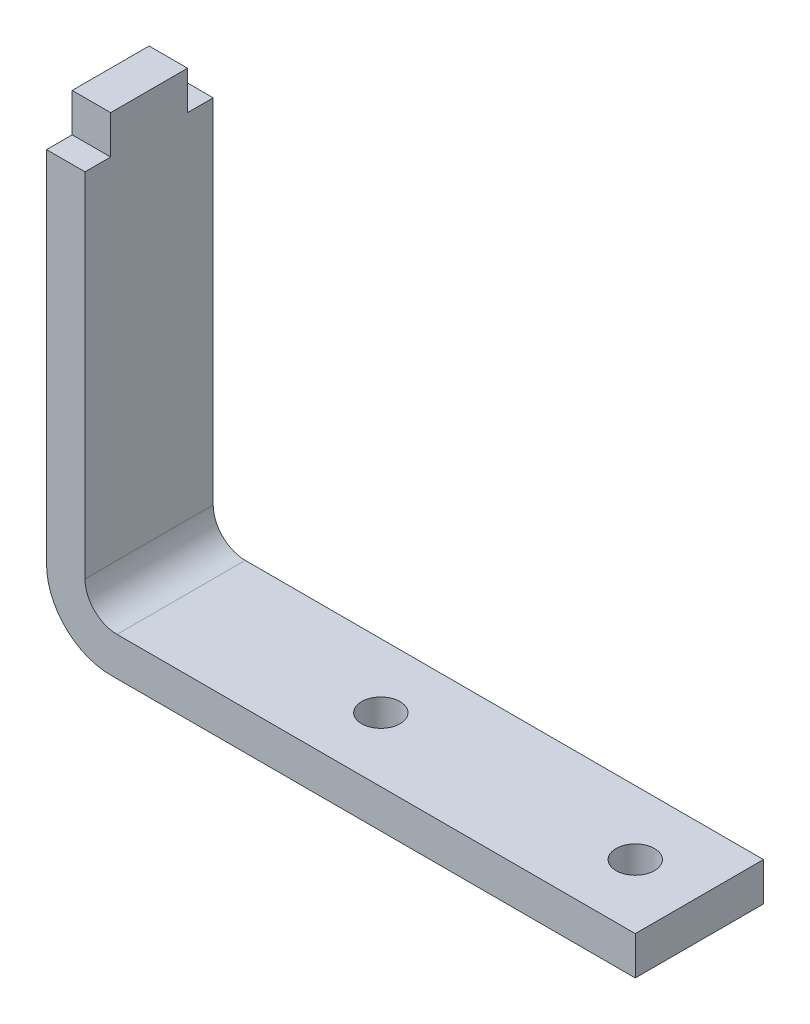
ISO-10303-21;
HEADER;
FILE_DESCRIPTION(('STEP AP214'),'2;1');
FILE_NAME('part.step','',(''),(''),'','','');
FILE_SCHEMA(('AUTOMOTIVE_DESIGN { 1 0 10303 214 1 1 1 1 }'));
ENDSEC;
DATA;
#1=APPLICATION_CONTEXT('core data for automotive mechanical design processes');
#2=APPLICATION_PROTOCOL_DEFINITION('international standard','automotive_design',2000,#1);
#3=PRODUCT_CONTEXT('',#1,'mechanical');
#4=PRODUCT('Part','Part','',(#3));
#5=PRODUCT_RELATED_PRODUCT_CATEGORY('part','',(#4));
#6=PRODUCT_DEFINITION_FORMATION('','',#4);
#7=PRODUCT_DEFINITION_CONTEXT('part definition',#1,'design');
#8=PRODUCT_DEFINITION('design','',#6,#7);
#9=PRODUCT_DEFINITION_SHAPE('','',#8);
#10=(LENGTH_UNIT() NAMED_UNIT(*) SI_UNIT(.MILLI.,.METRE.));
#11=(NAMED_UNIT(*) PLANE_ANGLE_UNIT() SI_UNIT($,.RADIAN.));
#12=(NAMED_UNIT(*) SI_UNIT($,.STERADIAN.) SOLID_ANGLE_UNIT());
#13=UNCERTAINTY_MEASURE_WITH_UNIT(LENGTH_MEASURE(1.E-05),#10,'distance_accuracy_value','');
#14=(GEOMETRIC_REPRESENTATION_CONTEXT(3) GLOBAL_UNCERTAINTY_ASSIGNED_CONTEXT((#13)) GLOBAL_UNIT_ASSIGNED_CONTEXT((#10,
#11,#12)) REPRESENTATION_CONTEXT('',''));
#15=CARTESIAN_POINT('',(0.,0.,0.));
#16=DIRECTION('',(0.,0.,1.));
#17=DIRECTION('',(1.,0.,0.));
#18=AXIS2_PLACEMENT_3D('',#15,#16,#17);
#19=CARTESIAN_POINT('',(0.,33.,-5.));
#20=DIRECTION('',(0.,-1.,0.));
#21=DIRECTION('',(0.,0.,-1.));
#22=AXIS2_PLACEMENT_3D('',#19,#20,#21);
#23=PLANE('',#22);
#24=DIRECTION('',(-1.,0.,0.));
#25=VECTOR('',#24,1.);
#26=CARTESIAN_POINT('',(-55.9999999999999,32.9999999999999,-3.));
#27=LINE('',#26,#25);
#28=CARTESIAN_POINT('',(-56.,33.,-3.));
#29=VERTEX_POINT('',#28);
#30=CARTESIAN_POINT('',(-58.9999999999999,32.9999999999999,-3.));
#31=VERTEX_POINT('',#30);
#32=EDGE_CURVE('E145',#29,#31,#27,.T.);
#33=ORIENTED_EDGE('',*,*,#32,.F.);
#34=DIRECTION('',(0.,0.,1.));
#35=VECTOR('',#34,1.);
#36=CARTESIAN_POINT('',(-56.,33.,-5.));
#37=LINE('',#36,#35);
#38=CARTESIAN_POINT('',(-56.,33.,-5.));
#39=VERTEX_POINT('',#38);
#40=EDGE_CURVE('E208',#39,#29,#37,.T.);
#41=ORIENTED_EDGE('',*,*,#40,.F.);
#42=DIRECTION('',(1.,0.,0.));
#43=VECTOR('',#42,1.);
#44=CARTESIAN_POINT('',(0.,33.,-5.));
#45=LINE('',#44,#43);
#46=CARTESIAN_POINT('',(-59.,33.,-5.));
#47=VERTEX_POINT('',#46);
#48=EDGE_CURVE('E188',#47,#39,#45,.T.);
#49=ORIENTED_EDGE('',*,*,#48,.F.);
#50=DIRECTION('',(0.,0.,1.));
#51=VECTOR('',#50,1.);
#52=CARTESIAN_POINT('',(-59.,33.,-5.));
#53=LINE('',#52,#51);
#54=EDGE_CURVE('E204',#47,#31,#53,.T.);
#55=ORIENTED_EDGE('',*,*,#54,.T.);
#56=EDGE_LOOP('',(#33,#41,#49,#55));
#57=FACE_BOUND('',#56,.T.);
#58=ADVANCED_FACE('F35',(#57),#23,.F.);
#59=CARTESIAN_POINT('',(0.,0.,-5.));
#60=DIRECTION('',(0.,1.,0.));
#61=DIRECTION('',(-1.,0.,0.));
#62=AXIS2_PLACEMENT_3D('',#59,#60,#61);
#63=PLANE('',#62);
#64=CARTESIAN_POINT('',(-18.075,0.,0.));
#65=DIRECTION('',(0.,1.,0.));
#66=DIRECTION('',(-1.,0.,0.));
#67=AXIS2_PLACEMENT_3D('',#64,#65,#66);
#68=CIRCLE('',#67,1.5);
#69=CARTESIAN_POINT('',(-19.575,0.,0.));
#70=VERTEX_POINT('',#69);
#71=EDGE_CURVE('E169',#70,#70,#68,.T.);
#72=ORIENTED_EDGE('',*,*,#71,.T.);
#73=EDGE_LOOP('',(#72));
#74=FACE_BOUND('',#73,.T.);
#75=CARTESIAN_POINT('',(-37.925,0.,0.));
#76=DIRECTION('',(0.,1.,0.));
#77=DIRECTION('',(-1.,0.,0.));
#78=AXIS2_PLACEMENT_3D('',#75,#76,#77);
#79=CIRCLE('',#78,1.5);
#80=CARTESIAN_POINT('',(-39.425,0.,0.));
#81=VERTEX_POINT('',#80);
#82=EDGE_CURVE('E176',#81,#81,#79,.T.);
#83=ORIENTED_EDGE('',*,*,#82,.T.);
#84=EDGE_LOOP('',(#83));
#85=FACE_BOUND('',#84,.T.);
#86=DIRECTION('',(-1.,0.,0.));
#87=VECTOR('',#86,1.);
#88=CARTESIAN_POINT('',(0.,0.,-5.));
#89=LINE('',#88,#87);
#90=CARTESIAN_POINT('',(-13.075,0.,-5.));
#91=VERTEX_POINT('',#90);
#92=CARTESIAN_POINT('',(-54.,0.,-5.));
#93=VERTEX_POINT('',#92);
#94=EDGE_CURVE('E192',#91,#93,#89,.T.);
#95=ORIENTED_EDGE('',*,*,#94,.F.);
#96=DIRECTION('',(0.,0.,1.));
#97=VECTOR('',#96,1.);
#98=CARTESIAN_POINT('',(-13.075,0.,5.));
#99=LINE('',#98,#97);
#100=CARTESIAN_POINT('',(-13.075,0.,5.));
#101=VERTEX_POINT('',#100);
#102=EDGE_CURVE('E159',#91,#101,#99,.T.);
#103=ORIENTED_EDGE('',*,*,#102,.T.);
#104=DIRECTION('',(-1.,0.,0.));
#105=VECTOR('',#104,1.);
#106=CARTESIAN_POINT('',(0.,0.,5.));
#107=LINE('',#106,#105);
#108=CARTESIAN_POINT('',(-54.,0.,5.));
#109=VERTEX_POINT('',#108);
#110=EDGE_CURVE('E185',#101,#109,#107,.T.);
#111=ORIENTED_EDGE('',*,*,#110,.T.);
#112=DIRECTION('',(0.,0.,1.));
#113=VECTOR('',#112,1.);
#114=CARTESIAN_POINT('',(-54.,0.,-5.));
#115=LINE('',#114,#113);
#116=EDGE_CURVE('E215',#109,#93,#115,.F.);
#117=ORIENTED_EDGE('',*,*,#116,.T.);
#118=EDGE_LOOP('',(#95,#103,#111,#117));
#119=FACE_BOUND('',#118,.T.);
#120=ADVANCED_FACE('F248',(#74,#85,#119),#63,.F.);
#121=CARTESIAN_POINT('',(-59.,0.,-5.));
#122=DIRECTION('',(1.,0.,0.));
#123=DIRECTION('',(0.,0.,-1.));
#124=AXIS2_PLACEMENT_3D('',#121,#122,#123);
#125=PLANE('',#124);
#126=DIRECTION('',(0.,1.,0.));
#127=VECTOR('',#126,1.);
#128=CARTESIAN_POINT('',(-59.,0.,-5.));
#129=LINE('',#128,#127);
#130=CARTESIAN_POINT('',(-59.,4.99999999999999,-5.));
#131=VERTEX_POINT('',#130);
#132=EDGE_CURVE('E190',#131,#47,#129,.T.);
#133=ORIENTED_EDGE('',*,*,#132,.F.);
#134=DIRECTION('',(0.,0.,1.));
#135=VECTOR('',#134,1.);
#136=CARTESIAN_POINT('',(-59.,4.99999999999999,-5.));
#137=LINE('',#136,#135);
#138=CARTESIAN_POINT('',(-59.,4.99999999999999,5.));
#139=VERTEX_POINT('',#138);
#140=EDGE_CURVE('E206',#131,#139,#137,.T.);
#141=ORIENTED_EDGE('',*,*,#140,.T.);
#142=DIRECTION('',(0.,1.,0.));
#143=VECTOR('',#142,1.);
#144=CARTESIAN_POINT('',(-59.,0.,5.));
#145=LINE('',#144,#143);
#146=CARTESIAN_POINT('',(-59.,33.,5.));
#147=VERTEX_POINT('',#146);
#148=EDGE_CURVE('E200',#139,#147,#145,.T.);
#149=ORIENTED_EDGE('',*,*,#148,.T.);
#150=CARTESIAN_POINT('',(-59.,33.,3.));
#151=VERTEX_POINT('',#150);
#152=EDGE_CURVE('E207',#151,#147,#53,.T.);
#153=ORIENTED_EDGE('',*,*,#152,.F.);
#154=DIRECTION('',(0.,-1.,0.));
#155=VECTOR('',#154,1.);
#156=CARTESIAN_POINT('',(-58.9999999999999,35.9999999999999,3.));
#157=LINE('',#156,#155);
#158=CARTESIAN_POINT('',(-58.9999999999999,35.9999999999999,3.));
#159=VERTEX_POINT('',#158);
#160=EDGE_CURVE('E128',#159,#151,#157,.T.);
#161=ORIENTED_EDGE('',*,*,#160,.F.);
#162=DIRECTION('',(0.,0.,1.));
#163=VECTOR('',#162,1.);
#164=CARTESIAN_POINT('',(-58.9999999999999,35.9999999999999,-3.));
#165=LINE('',#164,#163);
#166=CARTESIAN_POINT('',(-58.9999999999999,35.9999999999999,-3.));
#167=VERTEX_POINT('',#166);
#168=EDGE_CURVE('E136',#167,#159,#165,.T.);
#169=ORIENTED_EDGE('',*,*,#168,.F.);
#170=DIRECTION('',(0.,-1.,0.));
#171=VECTOR('',#170,1.);
#172=CARTESIAN_POINT('',(-58.9999999999999,35.9999999999999,-3.));
#173=LINE('',#172,#171);
#174=EDGE_CURVE('E155',#167,#31,#173,.T.);
#175=ORIENTED_EDGE('',*,*,#174,.T.);
#176=ORIENTED_EDGE('',*,*,#54,.F.);
#177=EDGE_LOOP('',(#133,#141,#149,#153,#161,#169,#175,#176));
#178=FACE_BOUND('',#177,.T.);
#179=ADVANCED_FACE('F255',(#178),#125,.F.);
#180=CARTESIAN_POINT('',(-56.,33.,3.));
#181=VERTEX_POINT('',#180);
#182=CARTESIAN_POINT('',(-56.,33.,5.));
#183=VERTEX_POINT('',#182);
#184=EDGE_CURVE('E55',#181,#183,#37,.T.);
#185=ORIENTED_EDGE('',*,*,#184,.F.);
#186=DIRECTION('',(-1.,0.,0.));
#187=VECTOR('',#186,1.);
#188=CARTESIAN_POINT('',(-55.9999999999999,32.9999999999999,3.));
#189=LINE('',#188,#187);
#190=EDGE_CURVE('E50',#181,#151,#189,.T.);
#191=ORIENTED_EDGE('',*,*,#190,.T.);
#192=ORIENTED_EDGE('',*,*,#152,.T.);
#193=DIRECTION('',(1.,0.,0.));
#194=VECTOR('',#193,1.);
#195=CARTESIAN_POINT('',(0.,33.,5.));
#196=LINE('',#195,#194);
#197=EDGE_CURVE('E198',#147,#183,#196,.T.);
#198=ORIENTED_EDGE('',*,*,#197,.T.);
#199=EDGE_LOOP('',(#185,#191,#192,#198));
#200=FACE_BOUND('',#199,.T.);
#201=ADVANCED_FACE('F271',(#200),#23,.F.);
#202=CARTESIAN_POINT('',(-56.,0.,-5.));
#203=DIRECTION('',(-1.,0.,0.));
#204=DIRECTION('',(0.,-1.,0.));
#205=AXIS2_PLACEMENT_3D('',#202,#203,#204);
#206=PLANE('',#205);
#207=DIRECTION('',(0.,-1.,0.));
#208=VECTOR('',#207,1.);
#209=CARTESIAN_POINT('',(-56.,0.,5.));
#210=LINE('',#209,#208);
#211=CARTESIAN_POINT('',(-56.,5.5,5.));
#212=VERTEX_POINT('',#211);
#213=EDGE_CURVE('E196',#183,#212,#210,.T.);
#214=ORIENTED_EDGE('',*,*,#213,.T.);
#215=DIRECTION('',(0.,0.,1.));
#216=VECTOR('',#215,1.);
#217=CARTESIAN_POINT('',(-56.,5.5,-5.));
#218=LINE('',#217,#216);
#219=CARTESIAN_POINT('',(-56.,5.5,-5.));
#220=VERTEX_POINT('',#219);
#221=EDGE_CURVE('E223',#212,#220,#218,.F.);
#222=ORIENTED_EDGE('',*,*,#221,.T.);
#223=DIRECTION('',(0.,-1.,0.));
#224=VECTOR('',#223,1.);
#225=CARTESIAN_POINT('',(-56.,0.,-5.));
#226=LINE('',#225,#224);
#227=EDGE_CURVE('E184',#39,#220,#226,.T.);
#228=ORIENTED_EDGE('',*,*,#227,.F.);
#229=ORIENTED_EDGE('',*,*,#40,.T.);
#230=DIRECTION('',(0.,-1.,0.));
#231=VECTOR('',#230,1.);
#232=CARTESIAN_POINT('',(-55.9999999999999,35.9999999999999,-3.));
#233=LINE('',#232,#231);
#234=CARTESIAN_POINT('',(-55.9999999999999,35.9999999999999,-3.));
#235=VERTEX_POINT('',#234);
#236=EDGE_CURVE('E143',#235,#29,#233,.T.);
#237=ORIENTED_EDGE('',*,*,#236,.F.);
#238=DIRECTION('',(0.,0.,1.));
#239=VECTOR('',#238,1.);
#240=CARTESIAN_POINT('',(-55.9999999999999,35.9999999999999,-3.));
#241=LINE('',#240,#239);
#242=CARTESIAN_POINT('',(-55.9999999999999,35.9999999999999,3.));
#243=VERTEX_POINT('',#242);
#244=EDGE_CURVE('E134',#235,#243,#241,.T.);
#245=ORIENTED_EDGE('',*,*,#244,.T.);
#246=DIRECTION('',(0.,-1.,0.));
#247=VECTOR('',#246,1.);
#248=CARTESIAN_POINT('',(-55.9999999999999,35.9999999999999,3.));
#249=LINE('',#248,#247);
#250=EDGE_CURVE('E121',#243,#181,#249,.T.);
#251=ORIENTED_EDGE('',*,*,#250,.T.);
#252=ORIENTED_EDGE('',*,*,#184,.T.);
#253=EDGE_LOOP('',(#214,#222,#228,#229,#237,#245,#251,#252));
#254=FACE_BOUND('',#253,.T.);
#255=ADVANCED_FACE('F140',(#254),#206,.F.);
#256=CARTESIAN_POINT('',(0.,3.,-5.));
#257=DIRECTION('',(0.,-1.,0.));
#258=DIRECTION('',(1.,0.,0.));
#259=AXIS2_PLACEMENT_3D('',#256,#257,#258);
#260=PLANE('',#259);
#261=CARTESIAN_POINT('',(-18.075,3.,0.));
#262=DIRECTION('',(0.,1.,0.));
#263=DIRECTION('',(-1.,0.,0.));
#264=AXIS2_PLACEMENT_3D('',#261,#262,#263);
#265=CIRCLE('',#264,1.5);
#266=CARTESIAN_POINT('',(-19.575,3.,0.));
#267=VERTEX_POINT('',#266);
#268=EDGE_CURVE('E173',#267,#267,#265,.T.);
#269=ORIENTED_EDGE('',*,*,#268,.F.);
#270=EDGE_LOOP('',(#269));
#271=FACE_BOUND('',#270,.T.);
#272=CARTESIAN_POINT('',(-37.925,3.,0.));
#273=DIRECTION('',(0.,1.,0.));
#274=DIRECTION('',(-1.,0.,0.));
#275=AXIS2_PLACEMENT_3D('',#272,#273,#274);
#276=CIRCLE('',#275,1.5);
#277=CARTESIAN_POINT('',(-39.425,3.,0.));
#278=VERTEX_POINT('',#277);
#279=EDGE_CURVE('E167',#278,#278,#276,.T.);
#280=ORIENTED_EDGE('',*,*,#279,.F.);
#281=EDGE_LOOP('',(#280));
#282=FACE_BOUND('',#281,.T.);
#283=DIRECTION('',(1.,0.,0.));
#284=VECTOR('',#283,1.);
#285=CARTESIAN_POINT('',(0.,3.,5.));
#286=LINE('',#285,#284);
#287=CARTESIAN_POINT('',(-53.5,3.,5.));
#288=VERTEX_POINT('',#287);
#289=CARTESIAN_POINT('',(-13.075,3.,5.));
#290=VERTEX_POINT('',#289);
#291=EDGE_CURVE('E172',#288,#290,#286,.T.);
#292=ORIENTED_EDGE('',*,*,#291,.T.);
#293=DIRECTION('',(0.,0.,1.));
#294=VECTOR('',#293,1.);
#295=CARTESIAN_POINT('',(-13.075,3.,5.));
#296=LINE('',#295,#294);
#297=CARTESIAN_POINT('',(-13.075,3.,-5.));
#298=VERTEX_POINT('',#297);
#299=EDGE_CURVE('E154',#298,#290,#296,.T.);
#300=ORIENTED_EDGE('',*,*,#299,.F.);
#301=DIRECTION('',(1.,0.,0.));
#302=VECTOR('',#301,1.);
#303=CARTESIAN_POINT('',(0.,3.,-5.));
#304=LINE('',#303,#302);
#305=CARTESIAN_POINT('',(-53.5,3.,-5.));
#306=VERTEX_POINT('',#305);
#307=EDGE_CURVE('E181',#306,#298,#304,.T.);
#308=ORIENTED_EDGE('',*,*,#307,.F.);
#309=DIRECTION('',(0.,0.,1.));
#310=VECTOR('',#309,1.);
#311=CARTESIAN_POINT('',(-53.5,3.,5.));
#312=LINE('',#311,#310);
#313=EDGE_CURVE('E220',#306,#288,#312,.T.);
#314=ORIENTED_EDGE('',*,*,#313,.T.);
#315=EDGE_LOOP('',(#292,#300,#308,#314));
#316=FACE_BOUND('',#315,.T.);
#317=ADVANCED_FACE('F240',(#271,#282,#316),#260,.F.);
#318=CARTESIAN_POINT('',(0.,0.,-5.));
#319=DIRECTION('',(0.,0.,1.));
#320=DIRECTION('',(1.,0.,0.));
#321=AXIS2_PLACEMENT_3D('',#318,#319,#320);
#322=PLANE('',#321);
#323=ORIENTED_EDGE('',*,*,#307,.T.);
#324=DIRECTION('',(0.,1.,0.));
#325=VECTOR('',#324,1.);
#326=CARTESIAN_POINT('',(-13.075,0.,-5.));
#327=LINE('',#326,#325);
#328=EDGE_CURVE('E162',#91,#298,#327,.T.);
#329=ORIENTED_EDGE('',*,*,#328,.F.);
#330=ORIENTED_EDGE('',*,*,#94,.T.);
#331=CARTESIAN_POINT('',(-54.,4.99999999999999,-5.));
#332=DIRECTION('',(0.,0.,1.));
#333=DIRECTION('',(1.,0.,0.));
#334=AXIS2_PLACEMENT_3D('',#331,#332,#333);
#335=CIRCLE('',#334,5.);
#336=EDGE_CURVE('E218',#93,#131,#335,.F.);
#337=ORIENTED_EDGE('',*,*,#336,.T.);
#338=ORIENTED_EDGE('',*,*,#132,.T.);
#339=ORIENTED_EDGE('',*,*,#48,.T.);
#340=ORIENTED_EDGE('',*,*,#227,.T.);
#341=CARTESIAN_POINT('',(-53.5,5.5,-5.));
#342=DIRECTION('',(0.,0.,1.));
#343=DIRECTION('',(1.,0.,0.));
#344=AXIS2_PLACEMENT_3D('',#341,#342,#343);
#345=CIRCLE('',#344,2.5);
#346=EDGE_CURVE('E11',#220,#306,#345,.T.);
#347=ORIENTED_EDGE('',*,*,#346,.T.);
#348=EDGE_LOOP('',(#323,#329,#330,#337,#338,#339,#340,#347));
#349=FACE_BOUND('',#348,.T.);
#350=ADVANCED_FACE('F236',(#349),#322,.F.);
#351=CARTESIAN_POINT('',(0.,0.,5.));
#352=DIRECTION('',(0.,0.,1.));
#353=DIRECTION('',(1.,0.,0.));
#354=AXIS2_PLACEMENT_3D('',#351,#352,#353);
#355=PLANE('',#354);
#356=DIRECTION('',(0.,1.,0.));
#357=VECTOR('',#356,1.);
#358=CARTESIAN_POINT('',(-13.075,0.,5.));
#359=LINE('',#358,#357);
#360=EDGE_CURVE('E164',#101,#290,#359,.T.);
#361=ORIENTED_EDGE('',*,*,#360,.T.);
#362=ORIENTED_EDGE('',*,*,#291,.F.);
#363=CARTESIAN_POINT('',(-53.5,5.5,5.));
#364=DIRECTION('',(0.,0.,1.));
#365=DIRECTION('',(1.,0.,0.));
#366=AXIS2_PLACEMENT_3D('',#363,#364,#365);
#367=CIRCLE('',#366,2.5);
#368=EDGE_CURVE('E43',#288,#212,#367,.F.);
#369=ORIENTED_EDGE('',*,*,#368,.T.);
#370=ORIENTED_EDGE('',*,*,#213,.F.);
#371=ORIENTED_EDGE('',*,*,#197,.F.);
#372=ORIENTED_EDGE('',*,*,#148,.F.);
#373=CARTESIAN_POINT('',(-54.,4.99999999999999,5.));
#374=DIRECTION('',(0.,0.,1.));
#375=DIRECTION('',(1.,0.,0.));
#376=AXIS2_PLACEMENT_3D('',#373,#374,#375);
#377=CIRCLE('',#376,5.);
#378=EDGE_CURVE('E212',#139,#109,#377,.T.);
#379=ORIENTED_EDGE('',*,*,#378,.T.);
#380=ORIENTED_EDGE('',*,*,#110,.F.);
#381=EDGE_LOOP('',(#361,#362,#369,#370,#371,#372,#379,#380));
#382=FACE_BOUND('',#381,.T.);
#383=ADVANCED_FACE('F227',(#382),#355,.T.);
#384=CARTESIAN_POINT('',(-37.925,0.,0.));
#385=DIRECTION('',(0.,1.,0.));
#386=DIRECTION('',(-1.,0.,0.));
#387=AXIS2_PLACEMENT_3D('',#384,#385,#386);
#388=CYLINDRICAL_SURFACE('',#387,1.5);
#389=ORIENTED_EDGE('',*,*,#82,.F.);
#390=EDGE_LOOP('',(#389));
#391=FACE_BOUND('',#390,.T.);
#392=ORIENTED_EDGE('',*,*,#279,.T.);
#393=EDGE_LOOP('',(#392));
#394=FACE_BOUND('',#393,.T.);
#395=ADVANCED_FACE('F264',(#391,#394),#388,.F.);
#396=CARTESIAN_POINT('',(-18.075,0.,0.));
#397=DIRECTION('',(0.,1.,0.));
#398=DIRECTION('',(-1.,0.,0.));
#399=AXIS2_PLACEMENT_3D('',#396,#397,#398);
#400=CYLINDRICAL_SURFACE('',#399,1.5);
#401=ORIENTED_EDGE('',*,*,#71,.F.);
#402=EDGE_LOOP('',(#401));
#403=FACE_BOUND('',#402,.T.);
#404=ORIENTED_EDGE('',*,*,#268,.T.);
#405=EDGE_LOOP('',(#404));
#406=FACE_BOUND('',#405,.T.);
#407=ADVANCED_FACE('F259',(#403,#406),#400,.F.);
#408=CARTESIAN_POINT('',(-54.,4.99999999999999,-5.));
#409=DIRECTION('',(0.,0.,1.));
#410=DIRECTION('',(1.,0.,0.));
#411=AXIS2_PLACEMENT_3D('',#408,#409,#410);
#412=CYLINDRICAL_SURFACE('',#411,5.);
#413=ORIENTED_EDGE('',*,*,#336,.F.);
#414=ORIENTED_EDGE('',*,*,#116,.F.);
#415=ORIENTED_EDGE('',*,*,#378,.F.);
#416=ORIENTED_EDGE('',*,*,#140,.F.);
#417=EDGE_LOOP('',(#413,#414,#415,#416));
#418=FACE_BOUND('',#417,.T.);
#419=ADVANCED_FACE('F257',(#418),#412,.T.);
#420=CARTESIAN_POINT('',(-53.5,5.5,-5.));
#421=DIRECTION('',(0.,0.,-1.));
#422=DIRECTION('',(-1.,0.,0.));
#423=AXIS2_PLACEMENT_3D('',#420,#421,#422);
#424=CYLINDRICAL_SURFACE('',#423,2.5);
#425=ORIENTED_EDGE('',*,*,#346,.F.);
#426=ORIENTED_EDGE('',*,*,#221,.F.);
#427=ORIENTED_EDGE('',*,*,#368,.F.);
#428=ORIENTED_EDGE('',*,*,#313,.F.);
#429=EDGE_LOOP('',(#425,#426,#427,#428));
#430=FACE_BOUND('',#429,.T.);
#431=ADVANCED_FACE('F37',(#430),#424,.F.);
#432=CARTESIAN_POINT('',(-13.075,0.,5.));
#433=DIRECTION('',(-1.,0.,0.));
#434=DIRECTION('',(0.,0.,1.));
#435=AXIS2_PLACEMENT_3D('',#432,#433,#434);
#436=PLANE('',#435);
#437=ORIENTED_EDGE('',*,*,#299,.T.);
#438=ORIENTED_EDGE('',*,*,#360,.F.);
#439=ORIENTED_EDGE('',*,*,#102,.F.);
#440=ORIENTED_EDGE('',*,*,#328,.T.);
#441=EDGE_LOOP('',(#437,#438,#439,#440));
#442=FACE_BOUND('',#441,.T.);
#443=ADVANCED_FACE('F242',(#442),#436,.F.);
#444=CARTESIAN_POINT('',(-55.9999999999999,35.9999999999999,-3.));
#445=DIRECTION('',(0.,0.,1.));
#446=DIRECTION('',(1.,0.,0.));
#447=AXIS2_PLACEMENT_3D('',#444,#445,#446);
#448=PLANE('',#447);
#449=ORIENTED_EDGE('',*,*,#32,.T.);
#450=ORIENTED_EDGE('',*,*,#174,.F.);
#451=DIRECTION('',(-1.,0.,0.));
#452=VECTOR('',#451,1.);
#453=CARTESIAN_POINT('',(-55.9999999999999,35.9999999999999,-3.));
#454=LINE('',#453,#452);
#455=EDGE_CURVE('E129',#235,#167,#454,.T.);
#456=ORIENTED_EDGE('',*,*,#455,.F.);
#457=ORIENTED_EDGE('',*,*,#236,.T.);
#458=EDGE_LOOP('',(#449,#450,#456,#457));
#459=FACE_BOUND('',#458,.T.);
#460=ADVANCED_FACE('F296',(#459),#448,.F.);
#461=CARTESIAN_POINT('',(-55.9999999999999,35.9999999999999,3.));
#462=DIRECTION('',(0.,0.,1.));
#463=DIRECTION('',(1.,0.,0.));
#464=AXIS2_PLACEMENT_3D('',#461,#462,#463);
#465=PLANE('',#464);
#466=ORIENTED_EDGE('',*,*,#190,.F.);
#467=ORIENTED_EDGE('',*,*,#250,.F.);
#468=DIRECTION('',(-1.,0.,0.));
#469=VECTOR('',#468,1.);
#470=CARTESIAN_POINT('',(-55.9999999999999,35.9999999999999,3.));
#471=LINE('',#470,#469);
#472=EDGE_CURVE('E125',#243,#159,#471,.T.);
#473=ORIENTED_EDGE('',*,*,#472,.T.);
#474=ORIENTED_EDGE('',*,*,#160,.T.);
#475=EDGE_LOOP('',(#466,#467,#473,#474));
#476=FACE_BOUND('',#475,.T.);
#477=ADVANCED_FACE('F123',(#476),#465,.T.);
#478=CARTESIAN_POINT('',(0.,36.,0.));
#479=DIRECTION('',(0.,-1.,0.));
#480=DIRECTION('',(1.,0.,0.));
#481=AXIS2_PLACEMENT_3D('',#478,#479,#480);
#482=PLANE('',#481);
#483=ORIENTED_EDGE('',*,*,#244,.F.);
#484=ORIENTED_EDGE('',*,*,#455,.T.);
#485=ORIENTED_EDGE('',*,*,#168,.T.);
#486=ORIENTED_EDGE('',*,*,#472,.F.);
#487=EDGE_LOOP('',(#483,#484,#485,#486));
#488=FACE_BOUND('',#487,.T.);
#489=ADVANCED_FACE('F133',(#488),#482,.F.);
#490=CLOSED_SHELL('',(#58,#120,#179,#201,#255,#317,#350,#383,#395,#407,#419,#431,#443,#460,#477,#489));
#491=MANIFOLD_SOLID_BREP('B2',#490);
#492=ADVANCED_BREP_SHAPE_REPRESENTATION('',(#18,#491),#14);
#493=SHAPE_DEFINITION_REPRESENTATION(#9,#492);
ENDSEC;
END-ISO-10303-21;
